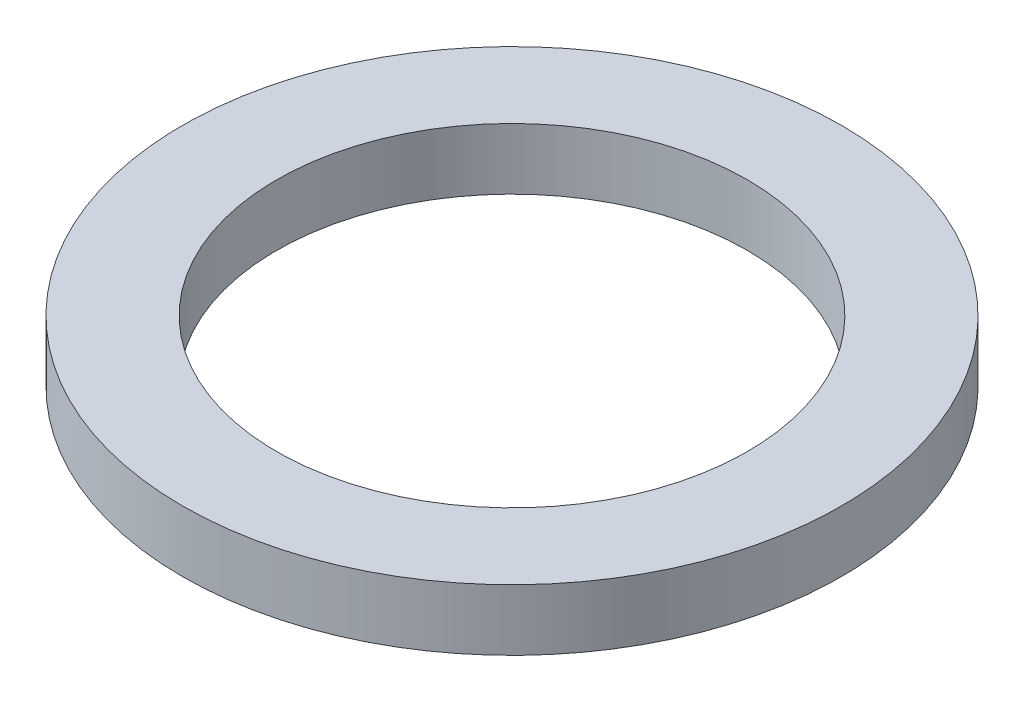
ISO-10303-21;
HEADER;
FILE_DESCRIPTION(('STEP AP214'),'2;1');
FILE_NAME('part.step','',(''),(''),'','','');
FILE_SCHEMA(('AUTOMOTIVE_DESIGN { 1 0 10303 214 1 1 1 1 }'));
ENDSEC;
DATA;
#1=APPLICATION_CONTEXT('core data for automotive mechanical design processes');
#2=APPLICATION_PROTOCOL_DEFINITION('international standard','automotive_design',2000,#1);
#3=PRODUCT_CONTEXT('',#1,'mechanical');
#4=PRODUCT('Part','Part','',(#3));
#5=PRODUCT_RELATED_PRODUCT_CATEGORY('part','',(#4));
#6=PRODUCT_DEFINITION_FORMATION('','',#4);
#7=PRODUCT_DEFINITION_CONTEXT('part definition',#1,'design');
#8=PRODUCT_DEFINITION('design','',#6,#7);
#9=PRODUCT_DEFINITION_SHAPE('','',#8);
#10=(LENGTH_UNIT() NAMED_UNIT(*) SI_UNIT(.MILLI.,.METRE.));
#11=(NAMED_UNIT(*) PLANE_ANGLE_UNIT() SI_UNIT($,.RADIAN.));
#12=(NAMED_UNIT(*) SI_UNIT($,.STERADIAN.) SOLID_ANGLE_UNIT());
#13=UNCERTAINTY_MEASURE_WITH_UNIT(LENGTH_MEASURE(1.E-05),#10,'distance_accuracy_value','');
#14=(GEOMETRIC_REPRESENTATION_CONTEXT(3) GLOBAL_UNCERTAINTY_ASSIGNED_CONTEXT((#13)) GLOBAL_UNIT_ASSIGNED_CONTEXT((#10,
#11,#12)) REPRESENTATION_CONTEXT('',''));
#15=CARTESIAN_POINT('',(0.,0.,0.));
#16=DIRECTION('',(0.,0.,1.));
#17=DIRECTION('',(1.,0.,0.));
#18=AXIS2_PLACEMENT_3D('',#15,#16,#17);
#19=CARTESIAN_POINT('',(0.,13.,0.));
#20=DIRECTION('',(0.,-1.,0.));
#21=DIRECTION('',(0.,0.,-1.));
#22=AXIS2_PLACEMENT_3D('',#19,#20,#21);
#23=CYLINDRICAL_SURFACE('',#22,70.);
#24=CARTESIAN_POINT('',(0.,13.,0.));
#25=DIRECTION('',(0.,1.,0.));
#26=DIRECTION('',(0.,0.,1.));
#27=AXIS2_PLACEMENT_3D('',#24,#25,#26);
#28=CIRCLE('',#27,70.);
#29=CARTESIAN_POINT('',(0.,13.,-70.));
#30=VERTEX_POINT('',#29);
#31=EDGE_CURVE('E10',#30,#30,#28,.T.);
#32=CARTESIAN_POINT('',(0.,0.,0.));
#33=DIRECTION('',(0.,1.,0.));
#34=DIRECTION('',(0.,0.,1.));
#35=AXIS2_PLACEMENT_3D('',#32,#33,#34);
#36=CIRCLE('',#35,70.);
#37=CARTESIAN_POINT('',(0.,0.,-70.));
#38=VERTEX_POINT('',#37);
#39=EDGE_CURVE('E37',#38,#38,#36,.T.);
#40=CARTESIAN_POINT('',(0.,13.,-70.));
#41=CARTESIAN_POINT('',(0.,12.8645833333333,-70.));
#42=CARTESIAN_POINT('',(0.,12.7291666666667,-70.));
#43=CARTESIAN_POINT('',(0.,12.4583333333333,-70.));
#44=CARTESIAN_POINT('',(0.,12.3229166666667,-70.));
#45=CARTESIAN_POINT('',(0.,12.0520833333333,-70.));
#46=CARTESIAN_POINT('',(0.,11.9166666666667,-70.));
#47=CARTESIAN_POINT('',(0.,11.6458333333333,-70.));
#48=CARTESIAN_POINT('',(0.,11.5104166666667,-70.));
#49=CARTESIAN_POINT('',(0.,11.2395833333333,-70.));
#50=CARTESIAN_POINT('',(0.,11.1041666666667,-70.));
#51=CARTESIAN_POINT('',(0.,10.8333333333333,-70.));
#52=CARTESIAN_POINT('',(0.,10.6979166666667,-70.));
#53=CARTESIAN_POINT('',(0.,10.4270833333333,-70.));
#54=CARTESIAN_POINT('',(0.,10.2916666666667,-70.));
#55=CARTESIAN_POINT('',(0.,10.0208333333333,-70.));
#56=CARTESIAN_POINT('',(0.,9.88541666666667,-70.));
#57=CARTESIAN_POINT('',(0.,9.61458333333333,-70.));
#58=CARTESIAN_POINT('',(0.,9.47916666666667,-70.));
#59=CARTESIAN_POINT('',(0.,9.20833333333333,-70.));
#60=CARTESIAN_POINT('',(0.,9.07291666666667,-70.));
#61=CARTESIAN_POINT('',(0.,8.80208333333333,-70.));
#62=CARTESIAN_POINT('',(0.,8.66666666666667,-70.));
#63=CARTESIAN_POINT('',(0.,8.39583333333333,-70.));
#64=CARTESIAN_POINT('',(0.,8.26041666666667,-70.));
#65=CARTESIAN_POINT('',(0.,7.98958333333333,-70.));
#66=CARTESIAN_POINT('',(0.,7.85416666666667,-70.));
#67=CARTESIAN_POINT('',(0.,7.58333333333333,-70.));
#68=CARTESIAN_POINT('',(0.,7.44791666666667,-70.));
#69=CARTESIAN_POINT('',(0.,7.17708333333333,-70.));
#70=CARTESIAN_POINT('',(0.,7.04166666666667,-70.));
#71=CARTESIAN_POINT('',(0.,6.77083333333333,-70.));
#72=CARTESIAN_POINT('',(0.,6.63541666666667,-70.));
#73=CARTESIAN_POINT('',(0.,6.36458333333333,-70.));
#74=CARTESIAN_POINT('',(0.,6.22916666666667,-70.));
#75=CARTESIAN_POINT('',(0.,5.95833333333333,-70.));
#76=CARTESIAN_POINT('',(0.,5.82291666666667,-70.));
#77=CARTESIAN_POINT('',(0.,5.55208333333333,-70.));
#78=CARTESIAN_POINT('',(0.,5.41666666666667,-70.));
#79=CARTESIAN_POINT('',(0.,5.14583333333333,-70.));
#80=CARTESIAN_POINT('',(0.,5.01041666666667,-70.));
#81=CARTESIAN_POINT('',(0.,4.73958333333333,-70.));
#82=CARTESIAN_POINT('',(0.,4.60416666666667,-70.));
#83=CARTESIAN_POINT('',(0.,4.33333333333333,-70.));
#84=CARTESIAN_POINT('',(0.,4.19791666666667,-70.));
#85=CARTESIAN_POINT('',(0.,3.92708333333333,-70.));
#86=CARTESIAN_POINT('',(0.,3.79166666666667,-70.));
#87=CARTESIAN_POINT('',(0.,3.52083333333333,-70.));
#88=CARTESIAN_POINT('',(0.,3.38541666666667,-70.));
#89=CARTESIAN_POINT('',(0.,3.11458333333333,-70.));
#90=CARTESIAN_POINT('',(0.,2.97916666666667,-70.));
#91=CARTESIAN_POINT('',(0.,2.70833333333333,-70.));
#92=CARTESIAN_POINT('',(0.,2.57291666666667,-70.));
#93=CARTESIAN_POINT('',(0.,2.30208333333333,-70.));
#94=CARTESIAN_POINT('',(0.,2.16666666666667,-70.));
#95=CARTESIAN_POINT('',(0.,1.89583333333333,-70.));
#96=CARTESIAN_POINT('',(0.,1.76041666666667,-70.));
#97=CARTESIAN_POINT('',(0.,1.48958333333333,-70.));
#98=CARTESIAN_POINT('',(0.,1.35416666666667,-70.));
#99=CARTESIAN_POINT('',(0.,1.08333333333333,-70.));
#100=CARTESIAN_POINT('',(0.,0.947916666666667,-70.));
#101=CARTESIAN_POINT('',(0.,0.677083333333334,-70.));
#102=CARTESIAN_POINT('',(0.,0.541666666666667,-70.));
#103=CARTESIAN_POINT('',(0.,0.270833333333334,-70.));
#104=CARTESIAN_POINT('',(0.,0.135416666666667,-70.));
#105=CARTESIAN_POINT('',(0.,0.,-70.));
#106=B_SPLINE_CURVE_WITH_KNOTS('',3,(#40,#41,#42,#43,#44,#45,#46,#47,#48,#49,#50,#51,#52,#53,
#54,#55,#56,#57,#58,#59,#60,#61,#62,#63,#64,#65,#66,#67,#68,#69,#70,#71,#72,#73,#74,#75,#76,#77,
#78,#79,#80,#81,#82,#83,#84,#85,#86,#87,#88,#89,#90,#91,#92,#93,#94,#95,#96,#97,#98,#99,#100,
#101,#102,#103,#104,#105),.UNSPECIFIED.,.F.,.F.,(4,2,2,2,2,2,2,2,2,2,2,2,2,2,2,2,2,2,2,2,2,2,2,
2,2,2,2,2,2,2,2,2,4),(0.,0.406249999999999,0.812499999999999,1.21875,1.625,2.03125,2.4375,
2.84375,3.25,3.65625,4.0625,4.46875,4.875,5.28125,5.6875,6.09375,6.5,6.90625,7.3125,7.71875,
8.125,8.53125,8.9375,9.34375,9.75,10.15625,10.5625,10.96875,11.375,11.78125,12.1875,12.59375,
13.),.UNSPECIFIED.);
#107=EDGE_CURVE('BSEAM40',#30,#38,#106,.T.);
#108=ORIENTED_EDGE('',*,*,#31,.F.);
#109=ORIENTED_EDGE('',*,*,#39,.T.);
#110=ORIENTED_EDGE('',*,*,#107,.T.);
#111=ORIENTED_EDGE('',*,*,#107,.F.);
#112=EDGE_LOOP('',(#108,#110,#109,#111));
#113=FACE_BOUND('',#112,.T.);
#114=ADVANCED_FACE('F40',(#113),#23,.T.);
#115=CARTESIAN_POINT('',(0.,13.,0.));
#116=DIRECTION('',(0.,1.,0.));
#117=DIRECTION('',(0.,0.,1.));
#118=AXIS2_PLACEMENT_3D('',#115,#116,#117);
#119=PLANE('',#118);
#120=CARTESIAN_POINT('',(0.,13.,0.));
#121=DIRECTION('',(0.,1.,0.));
#122=DIRECTION('',(0.,0.,1.));
#123=AXIS2_PLACEMENT_3D('',#120,#121,#122);
#124=CIRCLE('',#123,50.);
#125=CARTESIAN_POINT('',(0.,13.,-50.));
#126=VERTEX_POINT('',#125);
#127=EDGE_CURVE('E50',#126,#126,#124,.T.);
#128=ORIENTED_EDGE('',*,*,#127,.F.);
#129=EDGE_LOOP('',(#128));
#130=FACE_BOUND('',#129,.T.);
#131=ORIENTED_EDGE('',*,*,#31,.T.);
#132=EDGE_LOOP('',(#131));
#133=FACE_BOUND('',#132,.T.);
#134=ADVANCED_FACE('F59',(#130,#133),#119,.T.);
#135=CARTESIAN_POINT('',(0.,0.,0.));
#136=DIRECTION('',(0.,1.,0.));
#137=DIRECTION('',(0.,0.,1.));
#138=AXIS2_PLACEMENT_3D('',#135,#136,#137);
#139=PLANE('',#138);
#140=CARTESIAN_POINT('',(0.,0.,0.));
#141=DIRECTION('',(0.,1.,0.));
#142=DIRECTION('',(0.,0.,1.));
#143=AXIS2_PLACEMENT_3D('',#140,#141,#142);
#144=CIRCLE('',#143,50.);
#145=CARTESIAN_POINT('',(0.,0.,-50.));
#146=VERTEX_POINT('',#145);
#147=EDGE_CURVE('E47',#146,#146,#144,.T.);
#148=ORIENTED_EDGE('',*,*,#147,.T.);
#149=EDGE_LOOP('',(#148));
#150=FACE_BOUND('',#149,.T.);
#151=ORIENTED_EDGE('',*,*,#39,.F.);
#152=EDGE_LOOP('',(#151));
#153=FACE_BOUND('',#152,.T.);
#154=ADVANCED_FACE('F58',(#150,#153),#139,.F.);
#155=CARTESIAN_POINT('',(0.,13.,0.));
#156=DIRECTION('',(0.,-1.,0.));
#157=DIRECTION('',(0.,0.,-1.));
#158=AXIS2_PLACEMENT_3D('',#155,#156,#157);
#159=CYLINDRICAL_SURFACE('',#158,50.);
#160=CARTESIAN_POINT('',(0.,13.,-50.));
#161=CARTESIAN_POINT('',(0.,12.8645833333333,-50.));
#162=CARTESIAN_POINT('',(0.,12.7291666666667,-50.));
#163=CARTESIAN_POINT('',(0.,12.4583333333333,-50.));
#164=CARTESIAN_POINT('',(0.,12.3229166666667,-50.));
#165=CARTESIAN_POINT('',(0.,12.0520833333333,-50.));
#166=CARTESIAN_POINT('',(0.,11.9166666666667,-50.));
#167=CARTESIAN_POINT('',(0.,11.6458333333333,-50.));
#168=CARTESIAN_POINT('',(0.,11.5104166666667,-50.));
#169=CARTESIAN_POINT('',(0.,11.2395833333333,-50.));
#170=CARTESIAN_POINT('',(0.,11.1041666666667,-50.));
#171=CARTESIAN_POINT('',(0.,10.8333333333333,-50.));
#172=CARTESIAN_POINT('',(0.,10.6979166666667,-50.));
#173=CARTESIAN_POINT('',(0.,10.4270833333333,-50.));
#174=CARTESIAN_POINT('',(0.,10.2916666666667,-50.));
#175=CARTESIAN_POINT('',(0.,10.0208333333333,-50.));
#176=CARTESIAN_POINT('',(0.,9.88541666666667,-50.));
#177=CARTESIAN_POINT('',(0.,9.61458333333333,-50.));
#178=CARTESIAN_POINT('',(0.,9.47916666666667,-50.));
#179=CARTESIAN_POINT('',(0.,9.20833333333333,-50.));
#180=CARTESIAN_POINT('',(0.,9.07291666666666,-50.));
#181=CARTESIAN_POINT('',(0.,8.80208333333333,-50.));
#182=CARTESIAN_POINT('',(0.,8.66666666666667,-50.));
#183=CARTESIAN_POINT('',(0.,8.39583333333333,-50.));
#184=CARTESIAN_POINT('',(0.,8.26041666666667,-50.));
#185=CARTESIAN_POINT('',(0.,7.98958333333333,-50.));
#186=CARTESIAN_POINT('',(0.,7.85416666666667,-50.));
#187=CARTESIAN_POINT('',(0.,7.58333333333333,-50.));
#188=CARTESIAN_POINT('',(0.,7.44791666666667,-50.));
#189=CARTESIAN_POINT('',(0.,7.17708333333333,-50.));
#190=CARTESIAN_POINT('',(0.,7.04166666666667,-50.));
#191=CARTESIAN_POINT('',(0.,6.77083333333333,-50.));
#192=CARTESIAN_POINT('',(0.,6.63541666666667,-50.));
#193=CARTESIAN_POINT('',(0.,6.36458333333333,-50.));
#194=CARTESIAN_POINT('',(0.,6.22916666666667,-50.));
#195=CARTESIAN_POINT('',(0.,5.95833333333333,-50.));
#196=CARTESIAN_POINT('',(0.,5.82291666666667,-50.));
#197=CARTESIAN_POINT('',(0.,5.55208333333333,-50.));
#198=CARTESIAN_POINT('',(0.,5.41666666666667,-50.));
#199=CARTESIAN_POINT('',(0.,5.14583333333333,-50.));
#200=CARTESIAN_POINT('',(0.,5.01041666666667,-50.));
#201=CARTESIAN_POINT('',(0.,4.73958333333333,-50.));
#202=CARTESIAN_POINT('',(0.,4.60416666666667,-50.));
#203=CARTESIAN_POINT('',(0.,4.33333333333333,-50.));
#204=CARTESIAN_POINT('',(0.,4.19791666666667,-50.));
#205=CARTESIAN_POINT('',(0.,3.92708333333333,-50.));
#206=CARTESIAN_POINT('',(0.,3.79166666666667,-50.));
#207=CARTESIAN_POINT('',(0.,3.52083333333333,-50.));
#208=CARTESIAN_POINT('',(0.,3.38541666666667,-50.));
#209=CARTESIAN_POINT('',(0.,3.11458333333333,-50.));
#210=CARTESIAN_POINT('',(0.,2.97916666666667,-50.));
#211=CARTESIAN_POINT('',(0.,2.70833333333333,-50.));
#212=CARTESIAN_POINT('',(0.,2.57291666666667,-50.));
#213=CARTESIAN_POINT('',(0.,2.30208333333333,-50.));
#214=CARTESIAN_POINT('',(0.,2.16666666666667,-50.));
#215=CARTESIAN_POINT('',(0.,1.89583333333333,-50.));
#216=CARTESIAN_POINT('',(0.,1.76041666666667,-50.));
#217=CARTESIAN_POINT('',(0.,1.48958333333333,-50.));
#218=CARTESIAN_POINT('',(0.,1.35416666666667,-50.));
#219=CARTESIAN_POINT('',(0.,1.08333333333333,-50.));
#220=CARTESIAN_POINT('',(0.,0.947916666666667,-50.));
#221=CARTESIAN_POINT('',(0.,0.677083333333334,-50.));
#222=CARTESIAN_POINT('',(0.,0.541666666666667,-50.));
#223=CARTESIAN_POINT('',(0.,0.270833333333334,-50.));
#224=CARTESIAN_POINT('',(0.,0.135416666666667,-50.));
#225=CARTESIAN_POINT('',(0.,0.,-50.));
#226=B_SPLINE_CURVE_WITH_KNOTS('',3,(#160,#161,#162,#163,#164,#165,#166,#167,#168,#169,#170,
#171,#172,#173,#174,#175,#176,#177,#178,#179,#180,#181,#182,#183,#184,#185,#186,#187,#188,#189,
#190,#191,#192,#193,#194,#195,#196,#197,#198,#199,#200,#201,#202,#203,#204,#205,#206,#207,#208,
#209,#210,#211,#212,#213,#214,#215,#216,#217,#218,#219,#220,#221,#222,#223,#224,#225),
.UNSPECIFIED.,.F.,.F.,(4,2,2,2,2,2,2,2,2,2,2,2,2,2,2,2,2,2,2,2,2,2,2,2,2,2,2,2,2,2,2,2,4),(0.,
0.40625,0.812500000000001,1.21875,1.625,2.03125,2.4375,2.84375,3.25,3.65625,4.0625,4.46875,
4.875,5.28125,5.6875,6.09375,6.5,6.90625,7.3125,7.71875,8.125,8.53125,8.9375,9.34375,9.75,
10.15625,10.5625,10.96875,11.375,11.78125,12.1875,12.59375,13.),.UNSPECIFIED.);
#227=EDGE_CURVE('BSEAM54',#126,#146,#226,.T.);
#228=ORIENTED_EDGE('',*,*,#127,.T.);
#229=ORIENTED_EDGE('',*,*,#147,.F.);
#230=ORIENTED_EDGE('',*,*,#227,.T.);
#231=ORIENTED_EDGE('',*,*,#227,.F.);
#232=EDGE_LOOP('',(#228,#230,#229,#231));
#233=FACE_BOUND('',#232,.T.);
#234=ADVANCED_FACE('F54',(#233),#159,.F.);
#235=CLOSED_SHELL('',(#114,#134,#154,#234));
#236=MANIFOLD_SOLID_BREP('B2',#235);
#237=ADVANCED_BREP_SHAPE_REPRESENTATION('',(#18,#236),#14);
#238=SHAPE_DEFINITION_REPRESENTATION(#9,#237);
ENDSEC;
END-ISO-10303-21;
